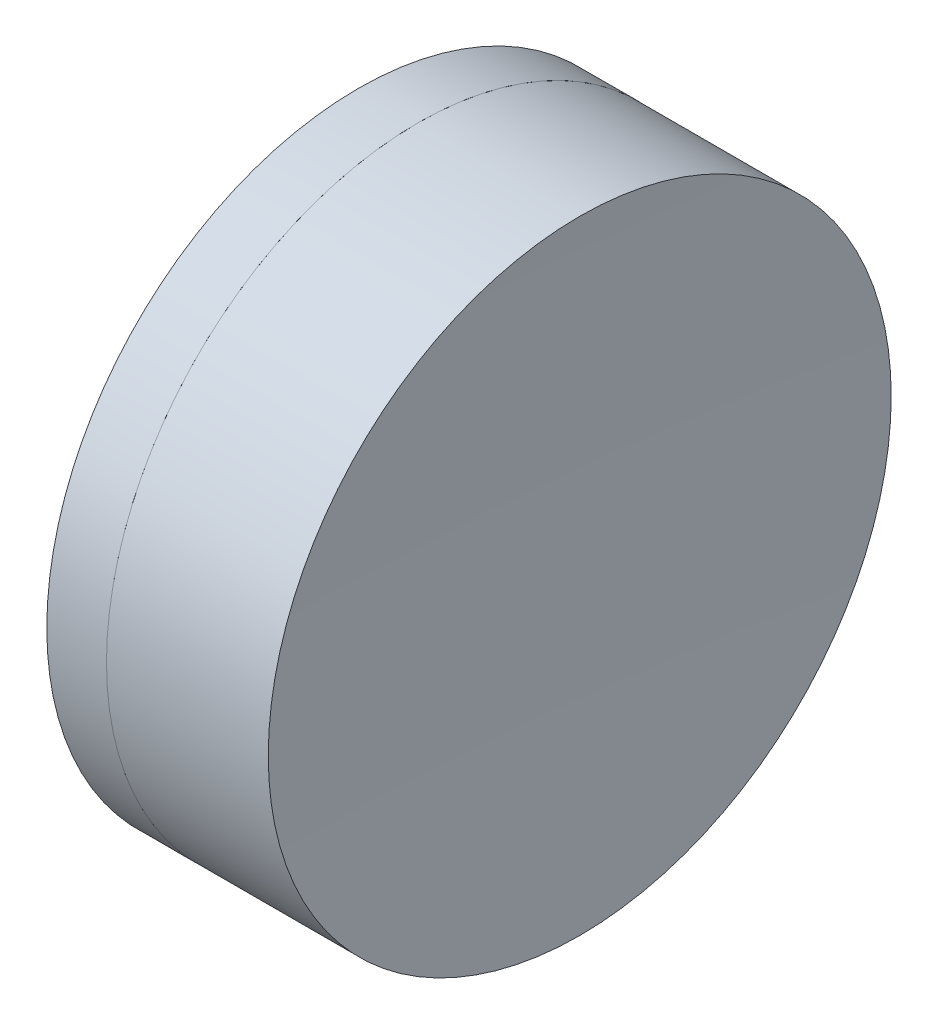
ISO-10303-21;
HEADER;
FILE_DESCRIPTION(('STEP AP214'),'2;1');
FILE_NAME('part.step','',(''),(''),'','','');
FILE_SCHEMA(('AUTOMOTIVE_DESIGN { 1 0 10303 214 1 1 1 1 }'));
ENDSEC;
DATA;
#1=APPLICATION_CONTEXT('core data for automotive mechanical design processes');
#2=APPLICATION_PROTOCOL_DEFINITION('international standard','automotive_design',2000,#1);
#3=PRODUCT_CONTEXT('',#1,'mechanical');
#4=PRODUCT('Part','Part','',(#3));
#5=PRODUCT_RELATED_PRODUCT_CATEGORY('part','',(#4));
#6=PRODUCT_DEFINITION_FORMATION('','',#4);
#7=PRODUCT_DEFINITION_CONTEXT('part definition',#1,'design');
#8=PRODUCT_DEFINITION('design','',#6,#7);
#9=PRODUCT_DEFINITION_SHAPE('','',#8);
#10=(LENGTH_UNIT() NAMED_UNIT(*) SI_UNIT(.MILLI.,.METRE.));
#11=(NAMED_UNIT(*) PLANE_ANGLE_UNIT() SI_UNIT($,.RADIAN.));
#12=(NAMED_UNIT(*) SI_UNIT($,.STERADIAN.) SOLID_ANGLE_UNIT());
#13=UNCERTAINTY_MEASURE_WITH_UNIT(LENGTH_MEASURE(1.E-05),#10,'distance_accuracy_value','');
#14=(GEOMETRIC_REPRESENTATION_CONTEXT(3) GLOBAL_UNCERTAINTY_ASSIGNED_CONTEXT((#13)) GLOBAL_UNIT_ASSIGNED_CONTEXT((#10,
#11,#12)) REPRESENTATION_CONTEXT('',''));
#15=CARTESIAN_POINT('',(0.,0.,0.));
#16=DIRECTION('',(0.,0.,1.));
#17=DIRECTION('',(1.,0.,0.));
#18=AXIS2_PLACEMENT_3D('',#15,#16,#17);
#19=CARTESIAN_POINT('',(12.2859251793895,0.,0.));
#20=DIRECTION('',(-1.,0.,0.));
#21=DIRECTION('',(0.,0.,-1.));
#22=AXIS2_PLACEMENT_3D('',#19,#20,#21);
#23=SPHERICAL_SURFACE('',#22,12.94);
#24=CARTESIAN_POINT('',(23.5607245124154,0.,0.));
#25=DIRECTION('',(-1.,0.,0.));
#26=DIRECTION('',(0.,0.,1.));
#27=AXIS2_PLACEMENT_3D('',#24,#25,#26);
#28=CIRCLE('',#27,6.35);
#29=CARTESIAN_POINT('',(23.5607245124154,0.,6.35));
#30=VERTEX_POINT('',#29);
#31=EDGE_CURVE('E51',#30,#30,#28,.T.);
#32=ORIENTED_EDGE('',*,*,#31,.T.);
#33=EDGE_LOOP('',(#32));
#34=FACE_BOUND('',#33,.T.);
#35=ADVANCED_FACE('F45',(#34),#23,.F.);
#36=CARTESIAN_POINT('',(178.43592517939,0.,0.));
#37=DIRECTION('',(-1.,0.,0.));
#38=DIRECTION('',(0.,0.,-1.));
#39=AXIS2_PLACEMENT_3D('',#36,#37,#38);
#40=SPHERICAL_SURFACE('',#39,151.71);
#41=CARTESIAN_POINT('',(26.8588767848519,0.,0.));
#42=DIRECTION('',(-1.,0.,0.));
#43=DIRECTION('',(0.,0.,1.));
#44=AXIS2_PLACEMENT_3D('',#41,#42,#43);
#45=CIRCLE('',#44,6.35);
#46=CARTESIAN_POINT('',(26.8588767848519,0.,6.35));
#47=VERTEX_POINT('',#46);
#48=EDGE_CURVE('E11',#47,#47,#45,.T.);
#49=ORIENTED_EDGE('',*,*,#48,.F.);
#50=EDGE_LOOP('',(#49));
#51=FACE_BOUND('',#50,.T.);
#52=ADVANCED_FACE('F60',(#51),#40,.F.);
#53=CARTESIAN_POINT('',(-0.551919992657797,0.,0.));
#54=DIRECTION('',(-1.,0.,0.));
#55=DIRECTION('',(0.,0.,1.));
#56=AXIS2_PLACEMENT_3D('',#53,#54,#55);
#57=CYLINDRICAL_SURFACE('',#56,6.35);
#58=ORIENTED_EDGE('',*,*,#48,.T.);
#59=EDGE_LOOP('',(#58));
#60=FACE_BOUND('',#59,.T.);
#61=ORIENTED_EDGE('',*,*,#31,.F.);
#62=EDGE_LOOP('',(#61));
#63=FACE_BOUND('',#62,.T.);
#64=ADVANCED_FACE('F58',(#60,#63),#57,.T.);
#65=CLOSED_SHELL('',(#35,#52,#64));
#66=MANIFOLD_SOLID_BREP('B2',#65);
#67=CARTESIAN_POINT('',(32.5259251793895,0.,0.));
#68=DIRECTION('',(-1.,0.,0.));
#69=DIRECTION('',(0.,0.,-1.));
#70=AXIS2_PLACEMENT_3D('',#67,#68,#69);
#71=SPHERICAL_SURFACE('',#70,12.);
#72=CARTESIAN_POINT('',(22.3437102926372,0.,0.));
#73=DIRECTION('',(-1.,0.,0.));
#74=DIRECTION('',(0.,0.,1.));
#75=AXIS2_PLACEMENT_3D('',#72,#73,#74);
#76=CIRCLE('',#75,6.35);
#77=CARTESIAN_POINT('',(22.3437102926372,0.,6.35));
#78=VERTEX_POINT('',#77);
#79=EDGE_CURVE('E44',#78,#78,#76,.T.);
#80=ORIENTED_EDGE('',*,*,#79,.T.);
#81=EDGE_LOOP('',(#80));
#82=FACE_BOUND('',#81,.T.);
#83=ADVANCED_FACE('F86',(#82),#71,.T.);
#84=CARTESIAN_POINT('',(-0.816062176165804,0.,0.));
#85=DIRECTION('',(-1.,0.,0.));
#86=DIRECTION('',(0.,0.,1.));
#87=AXIS2_PLACEMENT_3D('',#84,#85,#86);
#88=CYLINDRICAL_SURFACE('',#87,6.35);
#89=CARTESIAN_POINT('',(23.5607245124154,0.,0.));
#90=DIRECTION('',(-1.,0.,0.));
#91=DIRECTION('',(0.,0.,1.));
#92=AXIS2_PLACEMENT_3D('',#89,#90,#91);
#93=CIRCLE('',#92,6.35);
#94=CARTESIAN_POINT('',(23.5607245124154,0.,6.35));
#95=VERTEX_POINT('',#94);
#96=EDGE_CURVE('E92',#95,#95,#93,.T.);
#97=ORIENTED_EDGE('',*,*,#96,.T.);
#98=EDGE_LOOP('',(#97));
#99=FACE_BOUND('',#98,.T.);
#100=ORIENTED_EDGE('',*,*,#79,.F.);
#101=EDGE_LOOP('',(#100));
#102=FACE_BOUND('',#101,.T.);
#103=ADVANCED_FACE('F98',(#99,#102),#88,.T.);
#104=CARTESIAN_POINT('',(12.2859251793895,0.,0.));
#105=DIRECTION('',(-1.,0.,0.));
#106=DIRECTION('',(0.,0.,1.));
#107=AXIS2_PLACEMENT_3D('',#104,#105,#106);
#108=SPHERICAL_SURFACE('',#107,12.94);
#109=ORIENTED_EDGE('',*,*,#96,.F.);
#110=EDGE_LOOP('',(#109));
#111=FACE_BOUND('',#110,.T.);
#112=ADVANCED_FACE('F101',(#111),#108,.T.);
#113=CLOSED_SHELL('',(#83,#103,#112));
#114=MANIFOLD_SOLID_BREP('B6',#113);
#115=ADVANCED_BREP_SHAPE_REPRESENTATION('',(#18,#66,#114),#14);
#116=SHAPE_DEFINITION_REPRESENTATION(#9,#115);
ENDSEC;
END-ISO-10303-21;
